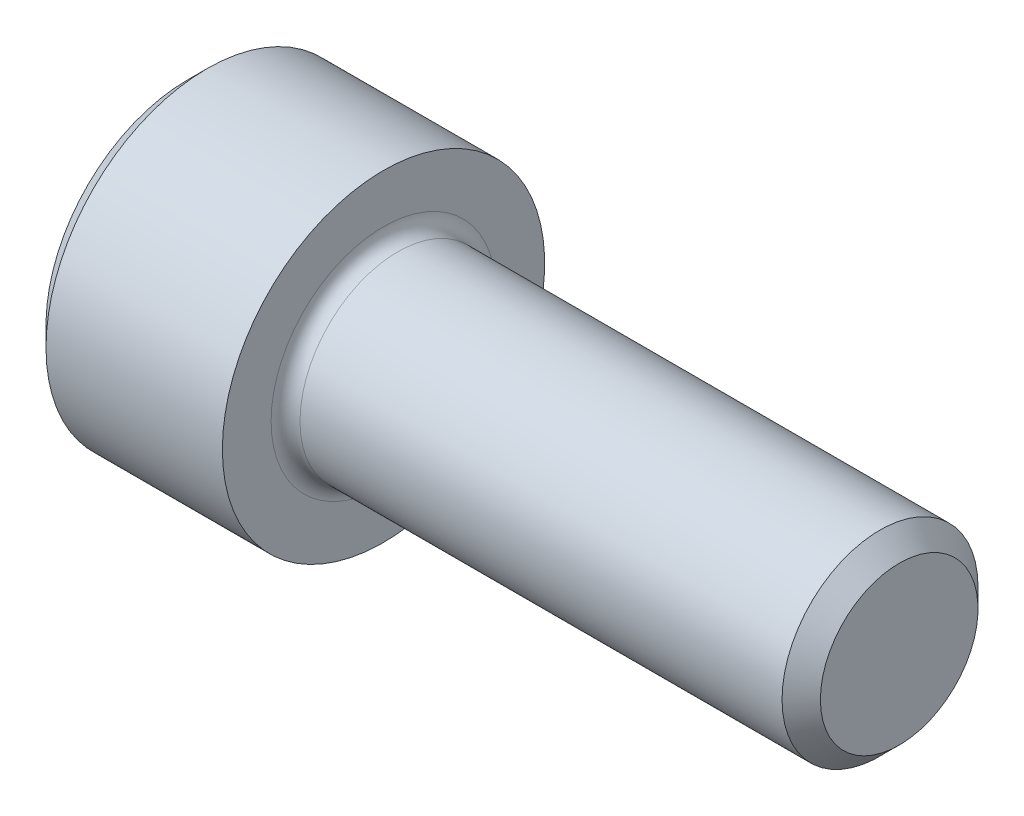
ISO-10303-21;
HEADER;
FILE_DESCRIPTION(('STEP AP214'),'2;1');
FILE_NAME('part.step','',(''),(''),'','','');
FILE_SCHEMA(('AUTOMOTIVE_DESIGN { 1 0 10303 214 1 1 1 1 }'));
ENDSEC;
DATA;
#1=APPLICATION_CONTEXT('core data for automotive mechanical design processes');
#2=APPLICATION_PROTOCOL_DEFINITION('international standard','automotive_design',2000,#1);
#3=PRODUCT_CONTEXT('',#1,'mechanical');
#4=PRODUCT('Part','Part','',(#3));
#5=PRODUCT_RELATED_PRODUCT_CATEGORY('part','',(#4));
#6=PRODUCT_DEFINITION_FORMATION('','',#4);
#7=PRODUCT_DEFINITION_CONTEXT('part definition',#1,'design');
#8=PRODUCT_DEFINITION('design','',#6,#7);
#9=PRODUCT_DEFINITION_SHAPE('','',#8);
#10=(LENGTH_UNIT() NAMED_UNIT(*) SI_UNIT(.MILLI.,.METRE.));
#11=(NAMED_UNIT(*) PLANE_ANGLE_UNIT() SI_UNIT($,.RADIAN.));
#12=(NAMED_UNIT(*) SI_UNIT($,.STERADIAN.) SOLID_ANGLE_UNIT());
#13=UNCERTAINTY_MEASURE_WITH_UNIT(LENGTH_MEASURE(1.E-05),#10,'distance_accuracy_value','');
#14=(GEOMETRIC_REPRESENTATION_CONTEXT(3) GLOBAL_UNCERTAINTY_ASSIGNED_CONTEXT((#13)) GLOBAL_UNIT_ASSIGNED_CONTEXT((#10,
#11,#12)) REPRESENTATION_CONTEXT('',''));
#15=CARTESIAN_POINT('',(0.,0.,0.));
#16=DIRECTION('',(0.,0.,1.));
#17=DIRECTION('',(1.,0.,0.));
#18=AXIS2_PLACEMENT_3D('',#15,#16,#17);
#19=CARTESIAN_POINT('',(2.286,1.14604605784411,1.98501));
#20=DIRECTION('',(-1.,0.,0.));
#21=DIRECTION('',(0.,0.,1.));
#22=AXIS2_PLACEMENT_3D('',#19,#20,#21);
#23=PLANE('',#22);
#24=DIRECTION('',(0.,0.500000000000001,0.866025403784438));
#25=VECTOR('',#24,1.);
#26=CARTESIAN_POINT('',(2.286,-1.71906908676614,0.992505));
#27=LINE('',#26,#25);
#28=CARTESIAN_POINT('',(2.2859999999804,-1.71906908679011,0.992505000013839));
#29=VERTEX_POINT('',#28);
#30=CARTESIAN_POINT('',(2.286,-1.14604605784409,1.98501));
#31=VERTEX_POINT('',#30);
#32=EDGE_CURVE('E122',#29,#31,#27,.T.);
#33=ORIENTED_EDGE('',*,*,#32,.T.);
#34=DIRECTION('',(0.,1.,0.));
#35=VECTOR('',#34,1.);
#36=CARTESIAN_POINT('',(2.286,1.14604605784411,1.98501));
#37=LINE('',#36,#35);
#38=CARTESIAN_POINT('',(2.28599999998701,0.,1.98501000001309));
#39=VERTEX_POINT('',#38);
#40=EDGE_CURVE('E117',#31,#39,#37,.T.);
#41=ORIENTED_EDGE('',*,*,#40,.T.);
#42=CARTESIAN_POINT('',(2.2859999999608,0.,0.));
#43=DIRECTION('',(-1.,0.,0.));
#44=DIRECTION('',(0.,0.,1.));
#45=AXIS2_PLACEMENT_3D('',#42,#43,#44);
#46=CIRCLE('',#45,1.98501000005535);
#47=EDGE_CURVE('E119',#39,#29,#46,.F.);
#48=ORIENTED_EDGE('',*,*,#47,.T.);
#49=EDGE_LOOP('',(#33,#41,#48));
#50=FACE_BOUND('',#49,.T.);
#51=ADVANCED_FACE('F16',(#50),#23,.T.);
#52=CARTESIAN_POINT('',(2.286,1.14604605784411,1.98501));
#53=DIRECTION('',(-1.,0.,0.));
#54=DIRECTION('',(0.,0.,1.));
#55=AXIS2_PLACEMENT_3D('',#52,#53,#54);
#56=PLANE('',#55);
#57=DIRECTION('',(0.,-0.499999999999998,0.86602540378444));
#58=VECTOR('',#57,1.);
#59=CARTESIAN_POINT('',(2.286,-1.71906908676615,-0.992504999999996));
#60=LINE('',#59,#58);
#61=CARTESIAN_POINT('',(2.2859999999804,-1.71906908679012,-0.992505000013836));
#62=VERTEX_POINT('',#61);
#63=CARTESIAN_POINT('',(2.286,-2.29209211568819,0.));
#64=VERTEX_POINT('',#63);
#65=EDGE_CURVE('E127',#62,#64,#60,.T.);
#66=ORIENTED_EDGE('',*,*,#65,.T.);
#67=DIRECTION('',(0.,0.500000000000001,0.866025403784438));
#68=VECTOR('',#67,1.);
#69=CARTESIAN_POINT('',(2.286,-2.29209211568819,0.));
#70=LINE('',#69,#68);
#71=EDGE_CURVE('E191',#64,#29,#70,.T.);
#72=ORIENTED_EDGE('',*,*,#71,.T.);
#73=CARTESIAN_POINT('',(2.2859999999608,0.,0.));
#74=DIRECTION('',(-1.,0.,0.));
#75=DIRECTION('',(0.,0.,1.));
#76=AXIS2_PLACEMENT_3D('',#73,#74,#75);
#77=CIRCLE('',#76,1.98501000005535);
#78=EDGE_CURVE('E139',#29,#62,#77,.F.);
#79=ORIENTED_EDGE('',*,*,#78,.T.);
#80=EDGE_LOOP('',(#66,#72,#79));
#81=FACE_BOUND('',#80,.T.);
#82=ADVANCED_FACE('F366',(#81),#56,.T.);
#83=CARTESIAN_POINT('',(2.286,1.14604605784411,1.98501));
#84=DIRECTION('',(-1.,0.,0.));
#85=DIRECTION('',(0.,0.,1.));
#86=AXIS2_PLACEMENT_3D('',#83,#84,#85);
#87=PLANE('',#86);
#88=DIRECTION('',(0.,1.,0.));
#89=VECTOR('',#88,1.);
#90=CARTESIAN_POINT('',(2.286,1.14604605784411,-1.98501));
#91=LINE('',#90,#89);
#92=CARTESIAN_POINT('',(2.28599999998701,0.,-1.98501000001309));
#93=VERTEX_POINT('',#92);
#94=CARTESIAN_POINT('',(2.286,-1.1460460578441,-1.98501));
#95=VERTEX_POINT('',#94);
#96=EDGE_CURVE('E187',#93,#95,#91,.F.);
#97=ORIENTED_EDGE('',*,*,#96,.T.);
#98=DIRECTION('',(0.,-0.499999999999999,0.866025403784439));
#99=VECTOR('',#98,1.);
#100=CARTESIAN_POINT('',(2.286,-1.1460460578441,-1.98501));
#101=LINE('',#100,#99);
#102=EDGE_CURVE('E183',#95,#62,#101,.T.);
#103=ORIENTED_EDGE('',*,*,#102,.T.);
#104=CARTESIAN_POINT('',(2.2859999999608,0.,0.));
#105=DIRECTION('',(-1.,0.,0.));
#106=DIRECTION('',(0.,0.,1.));
#107=AXIS2_PLACEMENT_3D('',#104,#105,#106);
#108=CIRCLE('',#107,1.98501000005535);
#109=EDGE_CURVE('E237',#62,#93,#108,.F.);
#110=ORIENTED_EDGE('',*,*,#109,.T.);
#111=EDGE_LOOP('',(#97,#103,#110));
#112=FACE_BOUND('',#111,.T.);
#113=ADVANCED_FACE('F363',(#112),#87,.T.);
#114=CARTESIAN_POINT('',(2.286,1.14604605784411,1.98501));
#115=DIRECTION('',(-1.,0.,0.));
#116=DIRECTION('',(0.,0.,1.));
#117=AXIS2_PLACEMENT_3D('',#114,#115,#116);
#118=PLANE('',#117);
#119=DIRECTION('',(0.,-0.500000000000001,-0.866025403784438));
#120=VECTOR('',#119,1.);
#121=CARTESIAN_POINT('',(2.286,1.71906908676615,-0.992505000000006));
#122=LINE('',#121,#120);
#123=CARTESIAN_POINT('',(2.2859999999804,1.71906908679012,-0.992505000013843));
#124=VERTEX_POINT('',#123);
#125=CARTESIAN_POINT('',(2.286,1.1460460578441,-1.98501));
#126=VERTEX_POINT('',#125);
#127=EDGE_CURVE('E179',#124,#126,#122,.T.);
#128=ORIENTED_EDGE('',*,*,#127,.T.);
#129=DIRECTION('',(0.,1.,0.));
#130=VECTOR('',#129,1.);
#131=CARTESIAN_POINT('',(2.286,1.14604605784411,-1.98501));
#132=LINE('',#131,#130);
#133=EDGE_CURVE('E175',#126,#93,#132,.F.);
#134=ORIENTED_EDGE('',*,*,#133,.T.);
#135=CARTESIAN_POINT('',(2.2859999999608,0.,0.));
#136=DIRECTION('',(-1.,0.,0.));
#137=DIRECTION('',(0.,0.,1.));
#138=AXIS2_PLACEMENT_3D('',#135,#136,#137);
#139=CIRCLE('',#138,1.98501000005535);
#140=EDGE_CURVE('E233',#93,#124,#139,.F.);
#141=ORIENTED_EDGE('',*,*,#140,.T.);
#142=EDGE_LOOP('',(#128,#134,#141));
#143=FACE_BOUND('',#142,.T.);
#144=ADVANCED_FACE('F359',(#143),#118,.T.);
#145=CARTESIAN_POINT('',(2.286,1.14604605784411,1.98501));
#146=DIRECTION('',(-1.,0.,0.));
#147=DIRECTION('',(0.,0.,1.));
#148=AXIS2_PLACEMENT_3D('',#145,#146,#147);
#149=PLANE('',#148);
#150=DIRECTION('',(0.,0.500000000000002,-0.866025403784437));
#151=VECTOR('',#150,1.);
#152=CARTESIAN_POINT('',(2.286,1.71906908676615,0.992504999999996));
#153=LINE('',#152,#151);
#154=CARTESIAN_POINT('',(2.2859999999804,1.71906908679012,0.992505000013835));
#155=VERTEX_POINT('',#154);
#156=CARTESIAN_POINT('',(2.286,2.2920921156882,0.));
#157=VERTEX_POINT('',#156);
#158=EDGE_CURVE('E171',#155,#157,#153,.T.);
#159=ORIENTED_EDGE('',*,*,#158,.T.);
#160=DIRECTION('',(0.,-0.500000000000002,-0.866025403784437));
#161=VECTOR('',#160,1.);
#162=CARTESIAN_POINT('',(2.286,2.2920921156882,0.));
#163=LINE('',#162,#161);
#164=EDGE_CURVE('E141',#157,#124,#163,.T.);
#165=ORIENTED_EDGE('',*,*,#164,.T.);
#166=CARTESIAN_POINT('',(2.2859999999608,0.,0.));
#167=DIRECTION('',(-1.,0.,0.));
#168=DIRECTION('',(0.,0.,1.));
#169=AXIS2_PLACEMENT_3D('',#166,#167,#168);
#170=CIRCLE('',#169,1.98501000005535);
#171=EDGE_CURVE('E149',#124,#155,#170,.F.);
#172=ORIENTED_EDGE('',*,*,#171,.T.);
#173=EDGE_LOOP('',(#159,#165,#172));
#174=FACE_BOUND('',#173,.T.);
#175=ADVANCED_FACE('F355',(#174),#149,.T.);
#176=CARTESIAN_POINT('',(2.28600000002643,0.,0.));
#177=DIRECTION('',(-1.,0.,0.));
#178=DIRECTION('',(0.,0.,1.));
#179=AXIS2_PLACEMENT_3D('',#176,#177,#178);
#180=CONICAL_SURFACE('',#179,1.98500999994167,1.04719755112655);
#181=CARTESIAN_POINT('',(3.43204605781011,0.,5.6843418860808E-11));
#182=VERTEX_POINT('',#181);
#183=VERTEX_LOOP('',#182);
#184=FACE_BOUND('',#183,.T.);
#185=ORIENTED_EDGE('',*,*,#47,.F.);
#186=CARTESIAN_POINT('',(2.2859999999608,0.,0.));
#187=DIRECTION('',(-1.,0.,0.));
#188=DIRECTION('',(0.,0.,1.));
#189=AXIS2_PLACEMENT_3D('',#186,#187,#188);
#190=CIRCLE('',#189,1.98501000005535);
#191=EDGE_CURVE('E135',#155,#39,#190,.F.);
#192=ORIENTED_EDGE('',*,*,#191,.F.);
#193=ORIENTED_EDGE('',*,*,#171,.F.);
#194=ORIENTED_EDGE('',*,*,#140,.F.);
#195=ORIENTED_EDGE('',*,*,#109,.F.);
#196=ORIENTED_EDGE('',*,*,#78,.F.);
#197=EDGE_LOOP('',(#185,#192,#193,#194,#195,#196));
#198=FACE_BOUND('',#197,.T.);
#199=ADVANCED_FACE('F133',(#184,#198),#180,.F.);
#200=CARTESIAN_POINT('',(2.286,1.14604605784411,1.98501));
#201=DIRECTION('',(-1.,0.,0.));
#202=DIRECTION('',(0.,0.,1.));
#203=AXIS2_PLACEMENT_3D('',#200,#201,#202);
#204=PLANE('',#203);
#205=DIRECTION('',(0.,-1.,0.));
#206=VECTOR('',#205,1.);
#207=CARTESIAN_POINT('',(2.286,-1.14604605784409,1.98501));
#208=LINE('',#207,#206);
#209=CARTESIAN_POINT('',(2.286,1.14604605784411,1.98501));
#210=VERTEX_POINT('',#209);
#211=EDGE_CURVE('E145',#39,#210,#208,.F.);
#212=ORIENTED_EDGE('',*,*,#211,.T.);
#213=DIRECTION('',(0.,0.499999999999998,-0.86602540378444));
#214=VECTOR('',#213,1.);
#215=CARTESIAN_POINT('',(2.286,2.2920921156882,0.));
#216=LINE('',#215,#214);
#217=EDGE_CURVE('E147',#155,#210,#216,.F.);
#218=ORIENTED_EDGE('',*,*,#217,.F.);
#219=ORIENTED_EDGE('',*,*,#191,.T.);
#220=EDGE_LOOP('',(#212,#218,#219));
#221=FACE_BOUND('',#220,.T.);
#222=ADVANCED_FACE('F144',(#221),#204,.T.);
#223=CARTESIAN_POINT('',(2.286,2.2920921156882,0.));
#224=DIRECTION('',(0.,-0.86602540378444,-0.499999999999998));
#225=DIRECTION('',(0.,0.499999999999998,-0.86602540378444));
#226=AXIS2_PLACEMENT_3D('',#223,#224,#225);
#227=PLANE('',#226);
#228=ORIENTED_EDGE('',*,*,#217,.T.);
#229=DIRECTION('',(1.,0.,0.));
#230=VECTOR('',#229,1.);
#231=CARTESIAN_POINT('',(2.286,1.14604605784411,1.98501));
#232=LINE('',#231,#230);
#233=CARTESIAN_POINT('',(0.,1.14604605784411,1.98501));
#234=VERTEX_POINT('',#233);
#235=EDGE_CURVE('E154',#210,#234,#232,.F.);
#236=ORIENTED_EDGE('',*,*,#235,.T.);
#237=DIRECTION('',(0.,-0.499999999999998,0.86602540378444));
#238=VECTOR('',#237,1.);
#239=CARTESIAN_POINT('',(0.,2.2920921156882,0.));
#240=LINE('',#239,#238);
#241=CARTESIAN_POINT('',(0.,2.2920921156882,0.));
#242=VERTEX_POINT('',#241);
#243=EDGE_CURVE('E165',#242,#234,#240,.T.);
#244=ORIENTED_EDGE('',*,*,#243,.F.);
#245=DIRECTION('',(1.,0.,0.));
#246=VECTOR('',#245,1.);
#247=CARTESIAN_POINT('',(2.286,2.2920921156882,0.));
#248=LINE('',#247,#246);
#249=EDGE_CURVE('E199',#242,#157,#248,.T.);
#250=ORIENTED_EDGE('',*,*,#249,.T.);
#251=ORIENTED_EDGE('',*,*,#158,.F.);
#252=EDGE_LOOP('',(#228,#236,#244,#250,#251));
#253=FACE_BOUND('',#252,.T.);
#254=ADVANCED_FACE('F347',(#253),#227,.T.);
#255=CARTESIAN_POINT('',(2.286,-1.14604605784409,1.98501));
#256=DIRECTION('',(0.,0.,1.));
#257=DIRECTION('',(0.,-1.,0.));
#258=AXIS2_PLACEMENT_3D('',#255,#256,#257);
#259=PLANE('',#258);
#260=ORIENTED_EDGE('',*,*,#235,.F.);
#261=ORIENTED_EDGE('',*,*,#211,.F.);
#262=ORIENTED_EDGE('',*,*,#40,.F.);
#263=DIRECTION('',(1.,0.,0.));
#264=VECTOR('',#263,1.);
#265=CARTESIAN_POINT('',(2.286,-1.14604605784409,1.98501));
#266=LINE('',#265,#264);
#267=CARTESIAN_POINT('',(0.,-1.14604605784409,1.98501));
#268=VERTEX_POINT('',#267);
#269=EDGE_CURVE('E160',#268,#31,#266,.T.);
#270=ORIENTED_EDGE('',*,*,#269,.F.);
#271=DIRECTION('',(0.,1.,0.));
#272=VECTOR('',#271,1.);
#273=CARTESIAN_POINT('',(0.,0.,1.98501));
#274=LINE('',#273,#272);
#275=EDGE_CURVE('E252',#234,#268,#274,.F.);
#276=ORIENTED_EDGE('',*,*,#275,.F.);
#277=EDGE_LOOP('',(#260,#261,#262,#270,#276));
#278=FACE_BOUND('',#277,.T.);
#279=ADVANCED_FACE('F152',(#278),#259,.F.);
#280=CARTESIAN_POINT('',(2.286,-1.14604605784409,1.98501));
#281=DIRECTION('',(0.,0.866025403784438,-0.500000000000001));
#282=DIRECTION('',(0.,0.500000000000001,0.866025403784438));
#283=AXIS2_PLACEMENT_3D('',#280,#281,#282);
#284=PLANE('',#283);
#285=ORIENTED_EDGE('',*,*,#71,.F.);
#286=DIRECTION('',(1.,0.,0.));
#287=VECTOR('',#286,1.);
#288=CARTESIAN_POINT('',(2.286,-2.29209211568819,0.));
#289=LINE('',#288,#287);
#290=CARTESIAN_POINT('',(0.,-2.29209211568819,0.));
#291=VERTEX_POINT('',#290);
#292=EDGE_CURVE('E209',#291,#64,#289,.T.);
#293=ORIENTED_EDGE('',*,*,#292,.F.);
#294=DIRECTION('',(0.,-0.500000000000001,-0.866025403784438));
#295=VECTOR('',#294,1.);
#296=CARTESIAN_POINT('',(0.,-1.14604605784409,1.98501));
#297=LINE('',#296,#295);
#298=EDGE_CURVE('E249',#268,#291,#297,.T.);
#299=ORIENTED_EDGE('',*,*,#298,.F.);
#300=ORIENTED_EDGE('',*,*,#269,.T.);
#301=ORIENTED_EDGE('',*,*,#32,.F.);
#302=EDGE_LOOP('',(#285,#293,#299,#300,#301));
#303=FACE_BOUND('',#302,.T.);
#304=ADVANCED_FACE('F340',(#303),#284,.T.);
#305=CARTESIAN_POINT('',(2.286,-2.29209211568819,0.));
#306=DIRECTION('',(0.,0.866025403784439,0.499999999999999));
#307=DIRECTION('',(0.,-0.499999999999999,0.866025403784439));
#308=AXIS2_PLACEMENT_3D('',#305,#306,#307);
#309=PLANE('',#308);
#310=ORIENTED_EDGE('',*,*,#102,.F.);
#311=DIRECTION('',(1.,0.,0.));
#312=VECTOR('',#311,1.);
#313=CARTESIAN_POINT('',(2.286,-1.1460460578441,-1.98501));
#314=LINE('',#313,#312);
#315=CARTESIAN_POINT('',(0.,-1.1460460578441,-1.98501));
#316=VERTEX_POINT('',#315);
#317=EDGE_CURVE('E204',#95,#316,#314,.F.);
#318=ORIENTED_EDGE('',*,*,#317,.T.);
#319=DIRECTION('',(0.,0.499999999999999,-0.86602540378444));
#320=VECTOR('',#319,1.);
#321=CARTESIAN_POINT('',(0.,-2.29209211568819,0.));
#322=LINE('',#321,#320);
#323=EDGE_CURVE('E251',#291,#316,#322,.T.);
#324=ORIENTED_EDGE('',*,*,#323,.F.);
#325=ORIENTED_EDGE('',*,*,#292,.T.);
#326=ORIENTED_EDGE('',*,*,#65,.F.);
#327=EDGE_LOOP('',(#310,#318,#324,#325,#326));
#328=FACE_BOUND('',#327,.T.);
#329=ADVANCED_FACE('F336',(#328),#309,.T.);
#330=CARTESIAN_POINT('',(2.286,1.1460460578441,-1.98501));
#331=DIRECTION('',(0.,0.,-1.));
#332=DIRECTION('',(0.,1.,0.));
#333=AXIS2_PLACEMENT_3D('',#330,#331,#332);
#334=PLANE('',#333);
#335=ORIENTED_EDGE('',*,*,#317,.F.);
#336=ORIENTED_EDGE('',*,*,#96,.F.);
#337=ORIENTED_EDGE('',*,*,#133,.F.);
#338=DIRECTION('',(1.,0.,0.));
#339=VECTOR('',#338,1.);
#340=CARTESIAN_POINT('',(2.286,1.1460460578441,-1.98501));
#341=LINE('',#340,#339);
#342=CARTESIAN_POINT('',(0.,1.1460460578441,-1.98501));
#343=VERTEX_POINT('',#342);
#344=EDGE_CURVE('E203',#126,#343,#341,.F.);
#345=ORIENTED_EDGE('',*,*,#344,.T.);
#346=DIRECTION('',(0.,1.,0.));
#347=VECTOR('',#346,1.);
#348=CARTESIAN_POINT('',(0.,0.,-1.98501));
#349=LINE('',#348,#347);
#350=EDGE_CURVE('E259',#316,#343,#349,.T.);
#351=ORIENTED_EDGE('',*,*,#350,.F.);
#352=EDGE_LOOP('',(#335,#336,#337,#345,#351));
#353=FACE_BOUND('',#352,.T.);
#354=ADVANCED_FACE('F332',(#353),#334,.F.);
#355=CARTESIAN_POINT('',(2.286,2.2920921156882,0.));
#356=DIRECTION('',(0.,0.866025403784438,-0.500000000000002));
#357=DIRECTION('',(0.,0.500000000000002,0.866025403784438));
#358=AXIS2_PLACEMENT_3D('',#355,#356,#357);
#359=PLANE('',#358);
#360=ORIENTED_EDGE('',*,*,#344,.F.);
#361=ORIENTED_EDGE('',*,*,#127,.F.);
#362=ORIENTED_EDGE('',*,*,#164,.F.);
#363=ORIENTED_EDGE('',*,*,#249,.F.);
#364=DIRECTION('',(0.,0.500000000000002,0.866025403784438));
#365=VECTOR('',#364,1.);
#366=CARTESIAN_POINT('',(0.,1.1460460578441,-1.98501));
#367=LINE('',#366,#365);
#368=EDGE_CURVE('E228',#343,#242,#367,.T.);
#369=ORIENTED_EDGE('',*,*,#368,.F.);
#370=EDGE_LOOP('',(#360,#361,#362,#363,#369));
#371=FACE_BOUND('',#370,.T.);
#372=ADVANCED_FACE('F328',(#371),#359,.F.);
#373=CARTESIAN_POINT('',(0.,0.,0.));
#374=DIRECTION('',(-1.,0.,0.));
#375=DIRECTION('',(0.,0.,1.));
#376=AXIS2_PLACEMENT_3D('',#373,#374,#375);
#377=PLANE('',#376);
#378=CARTESIAN_POINT('',(-5.6843418860808E-11,0.,0.));
#379=DIRECTION('',(1.,0.,0.));
#380=DIRECTION('',(0.,1.,0.));
#381=AXIS2_PLACEMENT_3D('',#378,#379,#380);
#382=CIRCLE('',#381,3.48615000001473);
#383=CARTESIAN_POINT('',(-5.68434426698877E-11,3.48615000001473,0.));
#384=VERTEX_POINT('',#383);
#385=EDGE_CURVE('E225',#384,#384,#382,.T.);
#386=ORIENTED_EDGE('',*,*,#385,.F.);
#387=EDGE_LOOP('',(#386));
#388=FACE_BOUND('',#387,.T.);
#389=ORIENTED_EDGE('',*,*,#350,.T.);
#390=ORIENTED_EDGE('',*,*,#368,.T.);
#391=ORIENTED_EDGE('',*,*,#243,.T.);
#392=ORIENTED_EDGE('',*,*,#275,.T.);
#393=ORIENTED_EDGE('',*,*,#298,.T.);
#394=ORIENTED_EDGE('',*,*,#323,.T.);
#395=EDGE_LOOP('',(#389,#390,#391,#392,#393,#394));
#396=FACE_BOUND('',#395,.T.);
#397=ADVANCED_FACE('F324',(#388,#396),#377,.T.);
#398=CARTESIAN_POINT('',(0.482599999998001,0.,0.));
#399=DIRECTION('',(1.,0.,0.));
#400=DIRECTION('',(0.,1.,0.));
#401=AXIS2_PLACEMENT_3D('',#398,#399,#400);
#402=CONICAL_SURFACE('',#401,3.96875000006958,0.785398163397448);
#403=ORIENTED_EDGE('',*,*,#385,.T.);
#404=EDGE_LOOP('',(#403));
#405=FACE_BOUND('',#404,.T.);
#406=CARTESIAN_POINT('',(0.4826,0.,0.));
#407=DIRECTION('',(-1.,0.,0.));
#408=DIRECTION('',(0.,0.,1.));
#409=AXIS2_PLACEMENT_3D('',#406,#407,#408);
#410=CIRCLE('',#409,3.96875);
#411=CARTESIAN_POINT('',(0.4826,0.,3.96875));
#412=VERTEX_POINT('',#411);
#413=EDGE_CURVE('E224',#412,#412,#410,.F.);
#414=ORIENTED_EDGE('',*,*,#413,.F.);
#415=EDGE_LOOP('',(#414));
#416=FACE_BOUND('',#415,.T.);
#417=ADVANCED_FACE('F320',(#405,#416),#402,.T.);
#418=CARTESIAN_POINT('',(-31.75,0.,0.));
#419=DIRECTION('',(-1.,0.,0.));
#420=DIRECTION('',(0.,0.,1.));
#421=AXIS2_PLACEMENT_3D('',#418,#419,#420);
#422=CYLINDRICAL_SURFACE('',#421,3.96875);
#423=CARTESIAN_POINT('',(4.826,0.,0.));
#424=DIRECTION('',(-1.,0.,0.));
#425=DIRECTION('',(0.,0.,1.));
#426=AXIS2_PLACEMENT_3D('',#423,#424,#425);
#427=CIRCLE('',#426,3.96875);
#428=CARTESIAN_POINT('',(4.826,0.,3.96875));
#429=VERTEX_POINT('',#428);
#430=EDGE_CURVE('E220',#429,#429,#427,.F.);
#431=ORIENTED_EDGE('',*,*,#430,.F.);
#432=EDGE_LOOP('',(#431));
#433=FACE_BOUND('',#432,.T.);
#434=ORIENTED_EDGE('',*,*,#413,.T.);
#435=EDGE_LOOP('',(#434));
#436=FACE_BOUND('',#435,.T.);
#437=ADVANCED_FACE('F316',(#433,#436),#422,.T.);
#438=CARTESIAN_POINT('',(17.526,1.94056,0.));
#439=DIRECTION('',(1.,0.,0.));
#440=DIRECTION('',(0.,0.,-1.));
#441=AXIS2_PLACEMENT_3D('',#438,#439,#440);
#442=PLANE('',#441);
#443=CARTESIAN_POINT('',(17.5259999999753,0.,0.));
#444=DIRECTION('',(-1.,0.,0.));
#445=DIRECTION('',(0.,0.,1.));
#446=AXIS2_PLACEMENT_3D('',#443,#444,#445);
#447=CIRCLE('',#446,1.94055999998);
#448=CARTESIAN_POINT('',(17.5259999999753,0.,1.94055999998));
#449=VERTEX_POINT('',#448);
#450=EDGE_CURVE('E215',#449,#449,#447,.T.);
#451=ORIENTED_EDGE('',*,*,#450,.F.);
#452=EDGE_LOOP('',(#451));
#453=FACE_BOUND('',#452,.T.);
#454=ADVANCED_FACE('F304',(#453),#442,.T.);
#455=CARTESIAN_POINT('',(4.826,3.96875,0.));
#456=DIRECTION('',(1.,0.,0.));
#457=DIRECTION('',(0.,0.,-1.));
#458=AXIS2_PLACEMENT_3D('',#455,#456,#457);
#459=PLANE('',#458);
#460=ORIENTED_EDGE('',*,*,#430,.T.);
#461=EDGE_LOOP('',(#460));
#462=FACE_BOUND('',#461,.T.);
#463=CARTESIAN_POINT('',(4.826,0.,0.));
#464=DIRECTION('',(1.,0.,0.));
#465=DIRECTION('',(0.,0.,1.));
#466=AXIS2_PLACEMENT_3D('',#463,#464,#465);
#467=CIRCLE('',#466,2.76859999999999);
#468=CARTESIAN_POINT('',(4.826,0.,-2.76859999999999));
#469=VERTEX_POINT('',#468);
#470=CARTESIAN_POINT('',(4.826,0.,2.76859999999999));
#471=VERTEX_POINT('',#470);
#472=EDGE_CURVE('E219',#469,#471,#467,.F.);
#473=ORIENTED_EDGE('',*,*,#472,.T.);
#474=CARTESIAN_POINT('',(4.826,0.,0.));
#475=DIRECTION('',(1.,0.,0.));
#476=DIRECTION('',(0.,0.,-1.));
#477=AXIS2_PLACEMENT_3D('',#474,#475,#476);
#478=CIRCLE('',#477,2.76859999999999);
#479=EDGE_CURVE('E40',#471,#469,#478,.F.);
#480=ORIENTED_EDGE('',*,*,#479,.T.);
#481=EDGE_LOOP('',(#473,#480));
#482=FACE_BOUND('',#481,.T.);
#483=ADVANCED_FACE('F295',(#462,#482),#459,.T.);
#484=CARTESIAN_POINT('',(17.0535599999084,0.,0.));
#485=DIRECTION('',(-1.,0.,0.));
#486=DIRECTION('',(0.,0.,1.));
#487=AXIS2_PLACEMENT_3D('',#484,#485,#486);
#488=CONICAL_SURFACE('',#487,2.41299999999001,0.785398163337289);
#489=CARTESIAN_POINT('',(17.05356,0.,0.));
#490=DIRECTION('',(-1.,0.,0.));
#491=DIRECTION('',(0.,0.,1.));
#492=AXIS2_PLACEMENT_3D('',#489,#490,#491);
#493=CIRCLE('',#492,2.41299999999999);
#494=CARTESIAN_POINT('',(17.05356,0.,2.41299999999999));
#495=VERTEX_POINT('',#494);
#496=EDGE_CURVE('E28',#495,#495,#493,.T.);
#497=ORIENTED_EDGE('',*,*,#496,.F.);
#498=EDGE_LOOP('',(#497));
#499=FACE_BOUND('',#498,.T.);
#500=ORIENTED_EDGE('',*,*,#450,.T.);
#501=EDGE_LOOP('',(#500));
#502=FACE_BOUND('',#501,.T.);
#503=ADVANCED_FACE('F286',(#499,#502),#488,.T.);
#504=CARTESIAN_POINT('',(5.1816,0.,0.));
#505=DIRECTION('',(1.,0.,0.));
#506=DIRECTION('',(0.,0.,-1.));
#507=AXIS2_PLACEMENT_3D('',#504,#505,#506);
#508=TOROIDAL_SURFACE('',#507,2.76859999999999,0.3556);
#509=CARTESIAN_POINT('',(5.1816,0.,0.));
#510=DIRECTION('',(-1.,0.,0.));
#511=DIRECTION('',(0.,0.,1.));
#512=AXIS2_PLACEMENT_3D('',#509,#510,#511);
#513=CIRCLE('',#512,2.41299999999999);
#514=CARTESIAN_POINT('',(5.1816,0.,2.41299999999999));
#515=VERTEX_POINT('',#514);
#516=EDGE_CURVE('E11',#515,#515,#513,.F.);
#517=ORIENTED_EDGE('',*,*,#516,.F.);
#518=EDGE_LOOP('',(#517));
#519=FACE_BOUND('',#518,.T.);
#520=ORIENTED_EDGE('',*,*,#472,.F.);
#521=ORIENTED_EDGE('',*,*,#479,.F.);
#522=EDGE_LOOP('',(#520,#521));
#523=FACE_BOUND('',#522,.T.);
#524=ADVANCED_FACE('F242',(#519,#523),#508,.F.);
#525=CARTESIAN_POINT('',(-31.75,0.,0.));
#526=DIRECTION('',(-1.,0.,0.));
#527=DIRECTION('',(0.,0.,1.));
#528=AXIS2_PLACEMENT_3D('',#525,#526,#527);
#529=CYLINDRICAL_SURFACE('',#528,2.41299999999999);
#530=ORIENTED_EDGE('',*,*,#516,.T.);
#531=EDGE_LOOP('',(#530));
#532=FACE_BOUND('',#531,.T.);
#533=ORIENTED_EDGE('',*,*,#496,.T.);
#534=EDGE_LOOP('',(#533));
#535=FACE_BOUND('',#534,.T.);
#536=ADVANCED_FACE('F285',(#532,#535),#529,.T.);
#537=CLOSED_SHELL('',(#51,#82,#113,#144,#175,#199,#222,#254,#279,#304,#329,#354,#372,#397,#417,
#437,#454,#483,#503,#524,#536));
#538=MANIFOLD_SOLID_BREP('B1',#537);
#539=ADVANCED_BREP_SHAPE_REPRESENTATION('',(#18,#538),#14);
#540=SHAPE_DEFINITION_REPRESENTATION(#9,#539);
ENDSEC;
END-ISO-10303-21;
